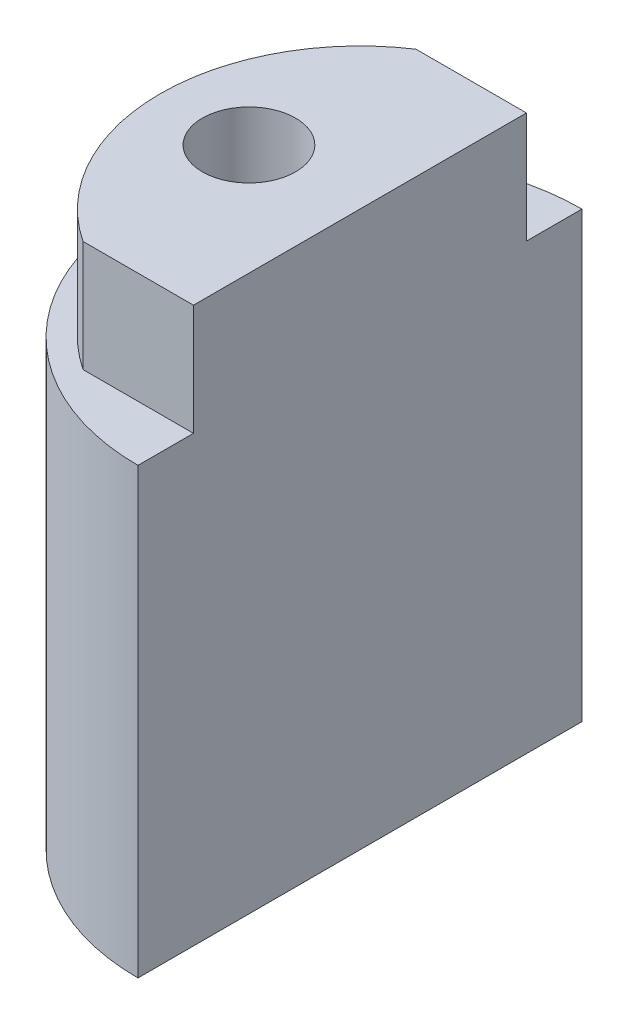
ISO-10303-21;
HEADER;
FILE_DESCRIPTION(('STEP AP214'),'2;1');
FILE_NAME('part.step','',(''),(''),'','','');
FILE_SCHEMA(('AUTOMOTIVE_DESIGN { 1 0 10303 214 1 1 1 1 }'));
ENDSEC;
DATA;
#1=APPLICATION_CONTEXT('core data for automotive mechanical design processes');
#2=APPLICATION_PROTOCOL_DEFINITION('international standard','automotive_design',2000,#1);
#3=PRODUCT_CONTEXT('',#1,'mechanical');
#4=PRODUCT('Part','Part','',(#3));
#5=PRODUCT_RELATED_PRODUCT_CATEGORY('part','',(#4));
#6=PRODUCT_DEFINITION_FORMATION('','',#4);
#7=PRODUCT_DEFINITION_CONTEXT('part definition',#1,'design');
#8=PRODUCT_DEFINITION('design','',#6,#7);
#9=PRODUCT_DEFINITION_SHAPE('','',#8);
#10=(LENGTH_UNIT() NAMED_UNIT(*) SI_UNIT(.MILLI.,.METRE.));
#11=(NAMED_UNIT(*) PLANE_ANGLE_UNIT() SI_UNIT($,.RADIAN.));
#12=(NAMED_UNIT(*) SI_UNIT($,.STERADIAN.) SOLID_ANGLE_UNIT());
#13=UNCERTAINTY_MEASURE_WITH_UNIT(LENGTH_MEASURE(1.E-05),#10,'distance_accuracy_value','');
#14=(GEOMETRIC_REPRESENTATION_CONTEXT(3) GLOBAL_UNCERTAINTY_ASSIGNED_CONTEXT((#13)) GLOBAL_UNIT_ASSIGNED_CONTEXT((#10,
#11,#12)) REPRESENTATION_CONTEXT('',''));
#15=CARTESIAN_POINT('',(0.,0.,0.));
#16=DIRECTION('',(0.,0.,1.));
#17=DIRECTION('',(1.,0.,0.));
#18=AXIS2_PLACEMENT_3D('',#15,#16,#17);
#19=CARTESIAN_POINT('',(0.,25.,0.));
#20=DIRECTION('',(0.,-1.,0.));
#21=DIRECTION('',(0.,0.,-1.));
#22=AXIS2_PLACEMENT_3D('',#19,#20,#21);
#23=CYLINDRICAL_SURFACE('',#22,10.);
#24=CARTESIAN_POINT('',(0.,20.,0.));
#25=DIRECTION('',(0.,1.,0.));
#26=DIRECTION('',(0.,0.,1.));
#27=AXIS2_PLACEMENT_3D('',#24,#25,#26);
#28=CIRCLE('',#27,10.);
#29=CARTESIAN_POINT('',(0.,20.,-10.));
#30=VERTEX_POINT('',#29);
#31=CARTESIAN_POINT('',(0.,20.,10.));
#32=VERTEX_POINT('',#31);
#33=EDGE_CURVE('E133',#30,#32,#28,.T.);
#34=ORIENTED_EDGE('',*,*,#33,.F.);
#35=DIRECTION('',(0.,-1.,0.));
#36=VECTOR('',#35,1.);
#37=CARTESIAN_POINT('',(0.,25.,-10.));
#38=LINE('',#37,#36);
#39=CARTESIAN_POINT('',(0.,0.,-10.));
#40=VERTEX_POINT('',#39);
#41=EDGE_CURVE('E56',#30,#40,#38,.T.);
#42=ORIENTED_EDGE('',*,*,#41,.T.);
#43=CARTESIAN_POINT('',(0.,0.,0.));
#44=DIRECTION('',(0.,1.,0.));
#45=DIRECTION('',(0.,0.,1.));
#46=AXIS2_PLACEMENT_3D('',#43,#44,#45);
#47=CIRCLE('',#46,10.);
#48=CARTESIAN_POINT('',(0.,0.,10.));
#49=VERTEX_POINT('',#48);
#50=EDGE_CURVE('E146',#40,#49,#47,.T.);
#51=ORIENTED_EDGE('',*,*,#50,.T.);
#52=DIRECTION('',(0.,-1.,0.));
#53=VECTOR('',#52,1.);
#54=CARTESIAN_POINT('',(0.,25.,10.));
#55=LINE('',#54,#53);
#56=EDGE_CURVE('E12',#32,#49,#55,.T.);
#57=ORIENTED_EDGE('',*,*,#56,.F.);
#58=EDGE_LOOP('',(#34,#42,#51,#57));
#59=FACE_BOUND('',#58,.T.);
#60=ADVANCED_FACE('F46',(#59),#23,.T.);
#61=CARTESIAN_POINT('',(0.,25.,-10.));
#62=DIRECTION('',(-1.,0.,0.));
#63=DIRECTION('',(0.,0.,1.));
#64=AXIS2_PLACEMENT_3D('',#61,#62,#63);
#65=PLANE('',#64);
#66=DIRECTION('',(0.,0.,-1.));
#67=VECTOR('',#66,1.);
#68=CARTESIAN_POINT('',(0.,25.,-10.));
#69=LINE('',#68,#67);
#70=CARTESIAN_POINT('',(0.,25.,7.5));
#71=VERTEX_POINT('',#70);
#72=CARTESIAN_POINT('',(0.,25.,-7.5));
#73=VERTEX_POINT('',#72);
#74=EDGE_CURVE('E155',#71,#73,#69,.T.);
#75=ORIENTED_EDGE('',*,*,#74,.F.);
#76=DIRECTION('',(0.,1.,0.));
#77=VECTOR('',#76,1.);
#78=CARTESIAN_POINT('',(0.,20.,7.5));
#79=LINE('',#78,#77);
#80=CARTESIAN_POINT('',(0.,20.,7.5));
#81=VERTEX_POINT('',#80);
#82=EDGE_CURVE('E147',#81,#71,#79,.T.);
#83=ORIENTED_EDGE('',*,*,#82,.F.);
#84=DIRECTION('',(0.,0.,-1.));
#85=VECTOR('',#84,1.);
#86=CARTESIAN_POINT('',(0.,20.,0.));
#87=LINE('',#86,#85);
#88=EDGE_CURVE('E134',#32,#81,#87,.T.);
#89=ORIENTED_EDGE('',*,*,#88,.F.);
#90=ORIENTED_EDGE('',*,*,#56,.T.);
#91=DIRECTION('',(0.,0.,-1.));
#92=VECTOR('',#91,1.);
#93=CARTESIAN_POINT('',(0.,0.,-10.));
#94=LINE('',#93,#92);
#95=EDGE_CURVE('E159',#49,#40,#94,.T.);
#96=ORIENTED_EDGE('',*,*,#95,.T.);
#97=ORIENTED_EDGE('',*,*,#41,.F.);
#98=CARTESIAN_POINT('',(0.,20.,-7.5));
#99=VERTEX_POINT('',#98);
#100=EDGE_CURVE('E130',#99,#30,#87,.T.);
#101=ORIENTED_EDGE('',*,*,#100,.F.);
#102=DIRECTION('',(0.,1.,0.));
#103=VECTOR('',#102,1.);
#104=CARTESIAN_POINT('',(0.,20.,-7.5));
#105=LINE('',#104,#103);
#106=EDGE_CURVE('E150',#99,#73,#105,.T.);
#107=ORIENTED_EDGE('',*,*,#106,.T.);
#108=EDGE_LOOP('',(#75,#83,#89,#90,#96,#97,#101,#107));
#109=FACE_BOUND('',#108,.T.);
#110=ADVANCED_FACE('F186',(#109),#65,.F.);
#111=CARTESIAN_POINT('',(0.,25.,0.));
#112=DIRECTION('',(0.,1.,0.));
#113=DIRECTION('',(0.,0.,1.));
#114=AXIS2_PLACEMENT_3D('',#111,#112,#113);
#115=PLANE('',#114);
#116=CARTESIAN_POINT('',(-5.,25.,0.));
#117=DIRECTION('',(0.,1.,0.));
#118=DIRECTION('',(0.,0.,1.));
#119=AXIS2_PLACEMENT_3D('',#116,#117,#118);
#120=CIRCLE('',#119,2.1);
#121=CARTESIAN_POINT('',(-5.,25.,2.1));
#122=VERTEX_POINT('',#121);
#123=EDGE_CURVE('E115',#122,#122,#120,.T.);
#124=ORIENTED_EDGE('',*,*,#123,.F.);
#125=EDGE_LOOP('',(#124));
#126=FACE_BOUND('',#125,.T.);
#127=DIRECTION('',(-1.,0.,0.));
#128=VECTOR('',#127,1.);
#129=CARTESIAN_POINT('',(0.,25.,7.5));
#130=LINE('',#129,#128);
#131=CARTESIAN_POINT('',(-4.9749371855331,25.,7.5));
#132=VERTEX_POINT('',#131);
#133=EDGE_CURVE('E49',#71,#132,#130,.T.);
#134=ORIENTED_EDGE('',*,*,#133,.F.);
#135=ORIENTED_EDGE('',*,*,#74,.T.);
#136=DIRECTION('',(-1.,0.,0.));
#137=VECTOR('',#136,1.);
#138=CARTESIAN_POINT('',(0.,25.,-7.5));
#139=LINE('',#138,#137);
#140=CARTESIAN_POINT('',(-4.9749371855331,25.,-7.5));
#141=VERTEX_POINT('',#140);
#142=EDGE_CURVE('E119',#73,#141,#139,.T.);
#143=ORIENTED_EDGE('',*,*,#142,.T.);
#144=CARTESIAN_POINT('',(0.,25.,0.));
#145=DIRECTION('',(0.,1.,0.));
#146=DIRECTION('',(0.,0.,1.));
#147=AXIS2_PLACEMENT_3D('',#144,#145,#146);
#148=CIRCLE('',#147,9.);
#149=EDGE_CURVE('E64',#141,#132,#148,.T.);
#150=ORIENTED_EDGE('',*,*,#149,.T.);
#151=EDGE_LOOP('',(#134,#135,#143,#150));
#152=FACE_BOUND('',#151,.T.);
#153=ADVANCED_FACE('F184',(#126,#152),#115,.T.);
#154=CARTESIAN_POINT('',(0.,0.,0.));
#155=DIRECTION('',(0.,1.,0.));
#156=DIRECTION('',(0.,0.,1.));
#157=AXIS2_PLACEMENT_3D('',#154,#155,#156);
#158=PLANE('',#157);
#159=ORIENTED_EDGE('',*,*,#50,.F.);
#160=ORIENTED_EDGE('',*,*,#95,.F.);
#161=EDGE_LOOP('',(#159,#160));
#162=FACE_BOUND('',#161,.T.);
#163=ADVANCED_FACE('F195',(#162),#158,.F.);
#164=CARTESIAN_POINT('',(0.,20.,0.));
#165=DIRECTION('',(0.,1.,0.));
#166=DIRECTION('',(0.,0.,1.));
#167=AXIS2_PLACEMENT_3D('',#164,#165,#166);
#168=CYLINDRICAL_SURFACE('',#167,9.);
#169=ORIENTED_EDGE('',*,*,#149,.F.);
#170=DIRECTION('',(0.,1.,0.));
#171=VECTOR('',#170,1.);
#172=CARTESIAN_POINT('',(-4.9749371855331,20.,-7.5));
#173=LINE('',#172,#171);
#174=CARTESIAN_POINT('',(-4.9749371855331,20.,-7.5));
#175=VERTEX_POINT('',#174);
#176=EDGE_CURVE('E140',#175,#141,#173,.T.);
#177=ORIENTED_EDGE('',*,*,#176,.F.);
#178=CARTESIAN_POINT('',(0.,20.,0.));
#179=DIRECTION('',(0.,1.,0.));
#180=DIRECTION('',(0.,0.,1.));
#181=AXIS2_PLACEMENT_3D('',#178,#179,#180);
#182=CIRCLE('',#181,9.);
#183=CARTESIAN_POINT('',(-4.9749371855331,20.,7.5));
#184=VERTEX_POINT('',#183);
#185=EDGE_CURVE('E124',#175,#184,#182,.T.);
#186=ORIENTED_EDGE('',*,*,#185,.T.);
#187=DIRECTION('',(0.,1.,0.));
#188=VECTOR('',#187,1.);
#189=CARTESIAN_POINT('',(-4.9749371855331,20.,7.5));
#190=LINE('',#189,#188);
#191=EDGE_CURVE('E143',#184,#132,#190,.T.);
#192=ORIENTED_EDGE('',*,*,#191,.T.);
#193=EDGE_LOOP('',(#169,#177,#186,#192));
#194=FACE_BOUND('',#193,.T.);
#195=ADVANCED_FACE('F193',(#194),#168,.T.);
#196=CARTESIAN_POINT('',(0.,20.,7.5));
#197=DIRECTION('',(0.,0.,-1.));
#198=DIRECTION('',(-1.,0.,0.));
#199=AXIS2_PLACEMENT_3D('',#196,#197,#198);
#200=PLANE('',#199);
#201=ORIENTED_EDGE('',*,*,#133,.T.);
#202=ORIENTED_EDGE('',*,*,#191,.F.);
#203=DIRECTION('',(-1.,0.,0.));
#204=VECTOR('',#203,1.);
#205=CARTESIAN_POINT('',(0.,20.,7.5));
#206=LINE('',#205,#204);
#207=EDGE_CURVE('E137',#81,#184,#206,.T.);
#208=ORIENTED_EDGE('',*,*,#207,.F.);
#209=ORIENTED_EDGE('',*,*,#82,.T.);
#210=EDGE_LOOP('',(#201,#202,#208,#209));
#211=FACE_BOUND('',#210,.T.);
#212=ADVANCED_FACE('F178',(#211),#200,.F.);
#213=CARTESIAN_POINT('',(0.,20.,-7.5));
#214=DIRECTION('',(0.,0.,-1.));
#215=DIRECTION('',(-1.,0.,0.));
#216=AXIS2_PLACEMENT_3D('',#213,#214,#215);
#217=PLANE('',#216);
#218=ORIENTED_EDGE('',*,*,#142,.F.);
#219=ORIENTED_EDGE('',*,*,#106,.F.);
#220=DIRECTION('',(-1.,0.,0.));
#221=VECTOR('',#220,1.);
#222=CARTESIAN_POINT('',(0.,20.,-7.5));
#223=LINE('',#222,#221);
#224=EDGE_CURVE('E127',#99,#175,#223,.T.);
#225=ORIENTED_EDGE('',*,*,#224,.T.);
#226=ORIENTED_EDGE('',*,*,#176,.T.);
#227=EDGE_LOOP('',(#218,#219,#225,#226));
#228=FACE_BOUND('',#227,.T.);
#229=ADVANCED_FACE('F190',(#228),#217,.T.);
#230=CARTESIAN_POINT('',(0.,20.,0.));
#231=DIRECTION('',(0.,1.,0.));
#232=DIRECTION('',(0.,0.,1.));
#233=AXIS2_PLACEMENT_3D('',#230,#231,#232);
#234=PLANE('',#233);
#235=ORIENTED_EDGE('',*,*,#185,.F.);
#236=ORIENTED_EDGE('',*,*,#224,.F.);
#237=ORIENTED_EDGE('',*,*,#100,.T.);
#238=ORIENTED_EDGE('',*,*,#33,.T.);
#239=ORIENTED_EDGE('',*,*,#88,.T.);
#240=ORIENTED_EDGE('',*,*,#207,.T.);
#241=EDGE_LOOP('',(#235,#236,#237,#238,#239,#240));
#242=FACE_BOUND('',#241,.T.);
#243=ADVANCED_FACE('F108',(#242),#234,.T.);
#244=CARTESIAN_POINT('',(-5.,13.8618072999579,0.));
#245=DIRECTION('',(0.,1.,0.));
#246=DIRECTION('',(0.,0.,1.));
#247=AXIS2_PLACEMENT_3D('',#244,#245,#246);
#248=CONICAL_SURFACE('',#247,2.1,1.02974425867665);
#249=CARTESIAN_POINT('',(-5.,12.6,0.));
#250=VERTEX_POINT('',#249);
#251=VERTEX_LOOP('',#250);
#252=FACE_BOUND('',#251,.T.);
#253=CARTESIAN_POINT('',(-5.,13.8618072999579,0.));
#254=DIRECTION('',(0.,1.,0.));
#255=DIRECTION('',(0.,0.,1.));
#256=AXIS2_PLACEMENT_3D('',#253,#254,#255);
#257=CIRCLE('',#256,2.1);
#258=CARTESIAN_POINT('',(-5.,13.8618072999579,2.1));
#259=VERTEX_POINT('',#258);
#260=EDGE_CURVE('E112',#259,#259,#257,.T.);
#261=ORIENTED_EDGE('',*,*,#260,.T.);
#262=EDGE_LOOP('',(#261));
#263=FACE_BOUND('',#262,.T.);
#264=ADVANCED_FACE('F104',(#252,#263),#248,.F.);
#265=CARTESIAN_POINT('',(-5.,25.,0.));
#266=DIRECTION('',(0.,1.,0.));
#267=DIRECTION('',(0.,0.,1.));
#268=AXIS2_PLACEMENT_3D('',#265,#266,#267);
#269=CYLINDRICAL_SURFACE('',#268,2.1);
#270=ORIENTED_EDGE('',*,*,#260,.F.);
#271=EDGE_LOOP('',(#270));
#272=FACE_BOUND('',#271,.T.);
#273=ORIENTED_EDGE('',*,*,#123,.T.);
#274=EDGE_LOOP('',(#273));
#275=FACE_BOUND('',#274,.T.);
#276=ADVANCED_FACE('F107',(#272,#275),#269,.F.);
#277=CLOSED_SHELL('',(#60,#110,#153,#163,#195,#212,#229,#243,#264,#276));
#278=MANIFOLD_SOLID_BREP('B2',#277);
#279=ADVANCED_BREP_SHAPE_REPRESENTATION('',(#18,#278),#14);
#280=SHAPE_DEFINITION_REPRESENTATION(#9,#279);
ENDSEC;
END-ISO-10303-21;
